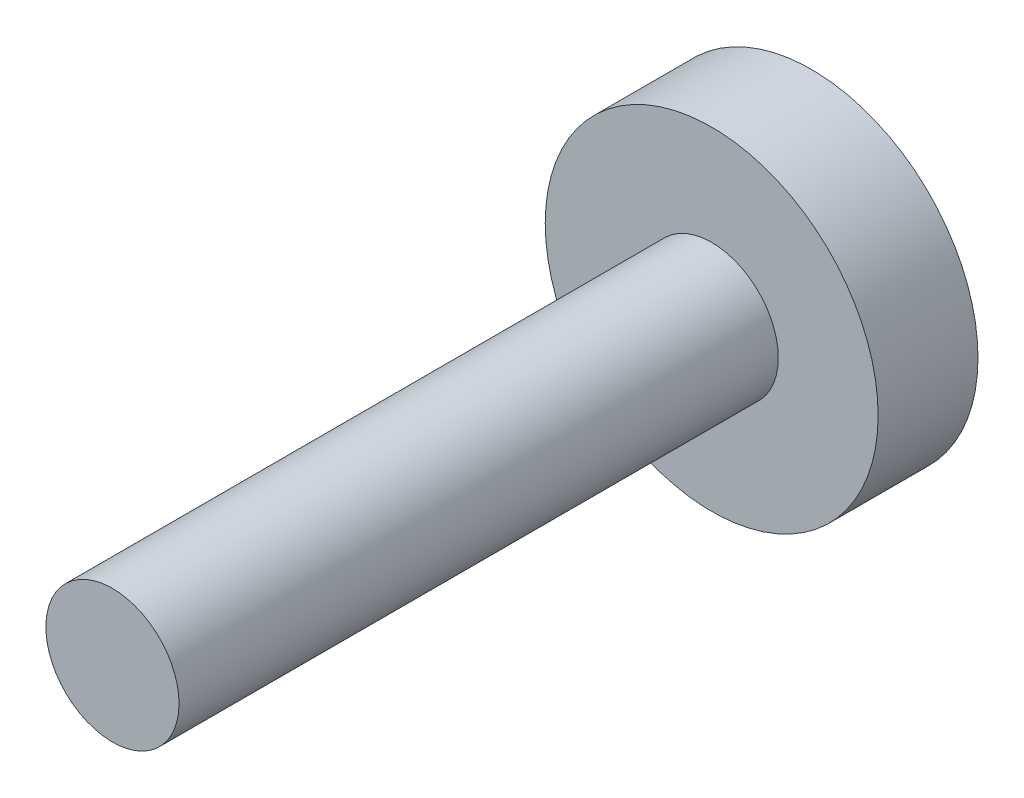
ISO-10303-21;
HEADER;
FILE_DESCRIPTION(('STEP AP214'),'2;1');
FILE_NAME('part.step','',(''),(''),'','','');
FILE_SCHEMA(('AUTOMOTIVE_DESIGN { 1 0 10303 214 1 1 1 1 }'));
ENDSEC;
DATA;
#1=APPLICATION_CONTEXT('core data for automotive mechanical design processes');
#2=APPLICATION_PROTOCOL_DEFINITION('international standard','automotive_design',2000,#1);
#3=PRODUCT_CONTEXT('',#1,'mechanical');
#4=PRODUCT('Part','Part','',(#3));
#5=PRODUCT_RELATED_PRODUCT_CATEGORY('part','',(#4));
#6=PRODUCT_DEFINITION_FORMATION('','',#4);
#7=PRODUCT_DEFINITION_CONTEXT('part definition',#1,'design');
#8=PRODUCT_DEFINITION('design','',#6,#7);
#9=PRODUCT_DEFINITION_SHAPE('','',#8);
#10=(LENGTH_UNIT() NAMED_UNIT(*) SI_UNIT(.MILLI.,.METRE.));
#11=(NAMED_UNIT(*) PLANE_ANGLE_UNIT() SI_UNIT($,.RADIAN.));
#12=(NAMED_UNIT(*) SI_UNIT($,.STERADIAN.) SOLID_ANGLE_UNIT());
#13=UNCERTAINTY_MEASURE_WITH_UNIT(LENGTH_MEASURE(1.E-05),#10,'distance_accuracy_value','');
#14=(GEOMETRIC_REPRESENTATION_CONTEXT(3) GLOBAL_UNCERTAINTY_ASSIGNED_CONTEXT((#13)) GLOBAL_UNIT_ASSIGNED_CONTEXT((#10,
#11,#12)) REPRESENTATION_CONTEXT('',''));
#15=CARTESIAN_POINT('',(0.,0.,0.));
#16=DIRECTION('',(0.,0.,1.));
#17=DIRECTION('',(1.,0.,0.));
#18=AXIS2_PLACEMENT_3D('',#15,#16,#17);
#19=CARTESIAN_POINT('',(0.,0.,3.));
#20=DIRECTION('',(0.,0.,1.));
#21=DIRECTION('',(1.,0.,0.));
#22=AXIS2_PLACEMENT_3D('',#19,#20,#21);
#23=PLANE('',#22);
#24=CARTESIAN_POINT('',(0.,0.,3.));
#25=DIRECTION('',(0.,0.,1.));
#26=DIRECTION('',(1.,0.,0.));
#27=AXIS2_PLACEMENT_3D('',#24,#25,#26);
#28=CIRCLE('',#27,5.);
#29=CARTESIAN_POINT('',(5.,0.,3.));
#30=VERTEX_POINT('',#29);
#31=EDGE_CURVE('E12',#30,#30,#28,.T.);
#32=ORIENTED_EDGE('',*,*,#31,.T.);
#33=EDGE_LOOP('',(#32));
#34=FACE_BOUND('',#33,.T.);
#35=CARTESIAN_POINT('',(0.,0.,3.));
#36=DIRECTION('',(0.,0.,1.));
#37=DIRECTION('',(1.,0.,0.));
#38=AXIS2_PLACEMENT_3D('',#35,#36,#37);
#39=CIRCLE('',#38,2.);
#40=CARTESIAN_POINT('',(2.,0.,3.));
#41=VERTEX_POINT('',#40);
#42=EDGE_CURVE('E55',#41,#41,#39,.T.);
#43=ORIENTED_EDGE('',*,*,#42,.F.);
#44=EDGE_LOOP('',(#43));
#45=FACE_BOUND('',#44,.T.);
#46=ADVANCED_FACE('F42',(#34,#45),#23,.T.);
#47=CARTESIAN_POINT('',(0.,0.,3.));
#48=DIRECTION('',(0.,0.,-1.));
#49=DIRECTION('',(-1.,0.,0.));
#50=AXIS2_PLACEMENT_3D('',#47,#48,#49);
#51=CYLINDRICAL_SURFACE('',#50,5.);
#52=ORIENTED_EDGE('',*,*,#31,.F.);
#53=EDGE_LOOP('',(#52));
#54=FACE_BOUND('',#53,.T.);
#55=CARTESIAN_POINT('',(0.,0.,0.));
#56=DIRECTION('',(0.,0.,1.));
#57=DIRECTION('',(1.,0.,0.));
#58=AXIS2_PLACEMENT_3D('',#55,#56,#57);
#59=CIRCLE('',#58,5.);
#60=CARTESIAN_POINT('',(5.,0.,0.));
#61=VERTEX_POINT('',#60);
#62=EDGE_CURVE('E46',#61,#61,#59,.T.);
#63=ORIENTED_EDGE('',*,*,#62,.T.);
#64=EDGE_LOOP('',(#63));
#65=FACE_BOUND('',#64,.T.);
#66=ADVANCED_FACE('F44',(#54,#65),#51,.T.);
#67=CARTESIAN_POINT('',(0.,0.,0.));
#68=DIRECTION('',(0.,0.,1.));
#69=DIRECTION('',(1.,0.,0.));
#70=AXIS2_PLACEMENT_3D('',#67,#68,#69);
#71=PLANE('',#70);
#72=ORIENTED_EDGE('',*,*,#62,.F.);
#73=EDGE_LOOP('',(#72));
#74=FACE_BOUND('',#73,.T.);
#75=ADVANCED_FACE('F66',(#74),#71,.F.);
#76=CARTESIAN_POINT('',(0.,0.,21.));
#77=DIRECTION('',(0.,0.,-1.));
#78=DIRECTION('',(-1.,0.,0.));
#79=AXIS2_PLACEMENT_3D('',#76,#77,#78);
#80=CYLINDRICAL_SURFACE('',#79,2.);
#81=CARTESIAN_POINT('',(0.,0.,21.));
#82=DIRECTION('',(0.,0.,1.));
#83=DIRECTION('',(1.,0.,0.));
#84=AXIS2_PLACEMENT_3D('',#81,#82,#83);
#85=CIRCLE('',#84,2.);
#86=CARTESIAN_POINT('',(2.,0.,21.));
#87=VERTEX_POINT('',#86);
#88=EDGE_CURVE('E53',#87,#87,#85,.T.);
#89=ORIENTED_EDGE('',*,*,#88,.F.);
#90=EDGE_LOOP('',(#89));
#91=FACE_BOUND('',#90,.T.);
#92=ORIENTED_EDGE('',*,*,#42,.T.);
#93=EDGE_LOOP('',(#92));
#94=FACE_BOUND('',#93,.T.);
#95=ADVANCED_FACE('F63',(#91,#94),#80,.T.);
#96=CARTESIAN_POINT('',(0.,0.,21.));
#97=DIRECTION('',(0.,0.,1.));
#98=DIRECTION('',(1.,0.,0.));
#99=AXIS2_PLACEMENT_3D('',#96,#97,#98);
#100=PLANE('',#99);
#101=ORIENTED_EDGE('',*,*,#88,.T.);
#102=EDGE_LOOP('',(#101));
#103=FACE_BOUND('',#102,.T.);
#104=ADVANCED_FACE('F61',(#103),#100,.T.);
#105=CLOSED_SHELL('',(#46,#66,#75,#95,#104));
#106=MANIFOLD_SOLID_BREP('B2',#105);
#107=ADVANCED_BREP_SHAPE_REPRESENTATION('',(#18,#106),#14);
#108=SHAPE_DEFINITION_REPRESENTATION(#9,#107);
ENDSEC;
END-ISO-10303-21;
